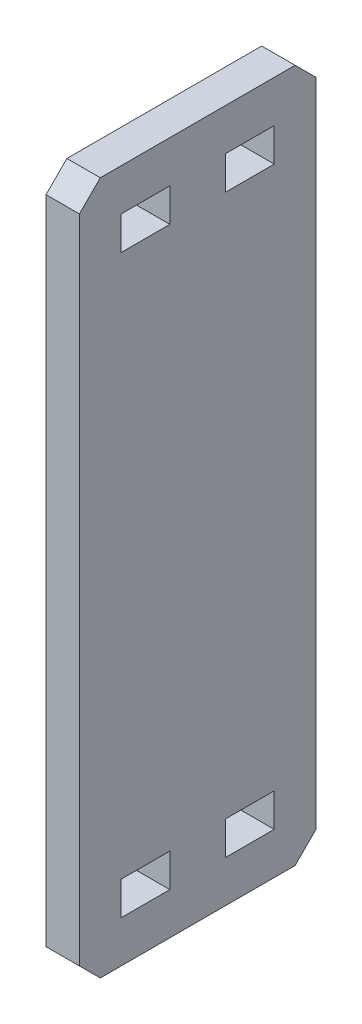
ISO-10303-21;
HEADER;
FILE_DESCRIPTION(('STEP AP214'),'2;1');
FILE_NAME('part.step','',(''),(''),'','','');
FILE_SCHEMA(('AUTOMOTIVE_DESIGN { 1 0 10303 214 1 1 1 1 }'));
ENDSEC;
DATA;
#1=APPLICATION_CONTEXT('core data for automotive mechanical design processes');
#2=APPLICATION_PROTOCOL_DEFINITION('international standard','automotive_design',2000,#1);
#3=PRODUCT_CONTEXT('',#1,'mechanical');
#4=PRODUCT('Part','Part','',(#3));
#5=PRODUCT_RELATED_PRODUCT_CATEGORY('part','',(#4));
#6=PRODUCT_DEFINITION_FORMATION('','',#4);
#7=PRODUCT_DEFINITION_CONTEXT('part definition',#1,'design');
#8=PRODUCT_DEFINITION('design','',#6,#7);
#9=PRODUCT_DEFINITION_SHAPE('','',#8);
#10=(LENGTH_UNIT() NAMED_UNIT(*) SI_UNIT(.MILLI.,.METRE.));
#11=(NAMED_UNIT(*) PLANE_ANGLE_UNIT() SI_UNIT($,.RADIAN.));
#12=(NAMED_UNIT(*) SI_UNIT($,.STERADIAN.) SOLID_ANGLE_UNIT());
#13=UNCERTAINTY_MEASURE_WITH_UNIT(LENGTH_MEASURE(1.E-05),#10,'distance_accuracy_value','');
#14=(GEOMETRIC_REPRESENTATION_CONTEXT(3) GLOBAL_UNCERTAINTY_ASSIGNED_CONTEXT((#13)) GLOBAL_UNIT_ASSIGNED_CONTEXT((#10,
#11,#12)) REPRESENTATION_CONTEXT('',''));
#15=CARTESIAN_POINT('',(0.,0.,0.));
#16=DIRECTION('',(0.,0.,1.));
#17=DIRECTION('',(1.,0.,0.));
#18=AXIS2_PLACEMENT_3D('',#15,#16,#17);
#19=CARTESIAN_POINT('',(3.048,0.,0.));
#20=DIRECTION('',(-1.,0.,0.));
#21=DIRECTION('',(0.,0.,1.));
#22=AXIS2_PLACEMENT_3D('',#19,#20,#21);
#23=PLANE('',#22);
#24=DIRECTION('',(0.,0.,1.));
#25=VECTOR('',#24,1.);
#26=CARTESIAN_POINT('',(3.048,-49.53,116.107292876109));
#27=LINE('',#26,#25);
#28=CARTESIAN_POINT('',(3.048,-49.53,116.107292876109));
#29=VERTEX_POINT('',#28);
#30=CARTESIAN_POINT('',(3.048,-49.53,124.997292876109));
#31=VERTEX_POINT('',#30);
#32=EDGE_CURVE('E238',#29,#31,#27,.T.);
#33=ORIENTED_EDGE('',*,*,#32,.F.);
#34=DIRECTION('',(0.,1.,0.));
#35=VECTOR('',#34,1.);
#36=CARTESIAN_POINT('',(3.048,-49.53,116.107292876109));
#37=LINE('',#36,#35);
#38=CARTESIAN_POINT('',(3.048,-55.626,116.107292876109));
#39=VERTEX_POINT('',#38);
#40=EDGE_CURVE('E246',#39,#29,#37,.T.);
#41=ORIENTED_EDGE('',*,*,#40,.F.);
#42=DIRECTION('',(0.,0.,-1.));
#43=VECTOR('',#42,1.);
#44=CARTESIAN_POINT('',(3.048,-55.626,116.107292876109));
#45=LINE('',#44,#43);
#46=CARTESIAN_POINT('',(3.048,-55.626,124.997292876109));
#47=VERTEX_POINT('',#46);
#48=EDGE_CURVE('E243',#47,#39,#45,.T.);
#49=ORIENTED_EDGE('',*,*,#48,.F.);
#50=DIRECTION('',(0.,-1.,0.));
#51=VECTOR('',#50,1.);
#52=CARTESIAN_POINT('',(3.048,-49.53,124.997292876109));
#53=LINE('',#52,#51);
#54=EDGE_CURVE('E240',#31,#47,#53,.T.);
#55=ORIENTED_EDGE('',*,*,#54,.F.);
#56=EDGE_LOOP('',(#33,#41,#49,#55));
#57=FACE_BOUND('',#56,.T.);
#58=DIRECTION('',(0.,-1.,0.));
#59=VECTOR('',#58,1.);
#60=CARTESIAN_POINT('',(3.048,55.626,105.947292876109));
#61=LINE('',#60,#59);
#62=CARTESIAN_POINT('',(3.048,55.626,105.947292876109));
#63=VERTEX_POINT('',#62);
#64=CARTESIAN_POINT('',(3.048,49.53,105.947292876109));
#65=VERTEX_POINT('',#64);
#66=EDGE_CURVE('E300',#63,#65,#61,.T.);
#67=ORIENTED_EDGE('',*,*,#66,.F.);
#68=DIRECTION('',(0.,0.,1.));
#69=VECTOR('',#68,1.);
#70=CARTESIAN_POINT('',(3.048,55.626,97.0572928761086));
#71=LINE('',#70,#69);
#72=CARTESIAN_POINT('',(3.048,55.626,97.0572928761086));
#73=VERTEX_POINT('',#72);
#74=EDGE_CURVE('E308',#73,#63,#71,.T.);
#75=ORIENTED_EDGE('',*,*,#74,.F.);
#76=DIRECTION('',(0.,1.,0.));
#77=VECTOR('',#76,1.);
#78=CARTESIAN_POINT('',(3.048,55.626,97.0572928761086));
#79=LINE('',#78,#77);
#80=CARTESIAN_POINT('',(3.048,49.53,97.0572928761086));
#81=VERTEX_POINT('',#80);
#82=EDGE_CURVE('E305',#81,#73,#79,.T.);
#83=ORIENTED_EDGE('',*,*,#82,.F.);
#84=DIRECTION('',(0.,0.,-1.));
#85=VECTOR('',#84,1.);
#86=CARTESIAN_POINT('',(3.048,49.53,97.0572928761086));
#87=LINE('',#86,#85);
#88=EDGE_CURVE('E302',#65,#81,#87,.T.);
#89=ORIENTED_EDGE('',*,*,#88,.F.);
#90=EDGE_LOOP('',(#67,#75,#83,#89));
#91=FACE_BOUND('',#90,.T.);
#92=DIRECTION('',(0.,0.,-1.));
#93=VECTOR('',#92,1.);
#94=CARTESIAN_POINT('',(3.048,-63.246,89.4372928761086));
#95=LINE('',#94,#93);
#96=CARTESIAN_POINT('',(3.048,-63.246,128.807292876109));
#97=VERTEX_POINT('',#96);
#98=CARTESIAN_POINT('',(3.048,-63.246,93.2472928761086));
#99=VERTEX_POINT('',#98);
#100=EDGE_CURVE('E339',#97,#99,#95,.T.);
#101=ORIENTED_EDGE('',*,*,#100,.T.);
#102=DIRECTION('',(0.,-0.707106781186546,0.707106781186549));
#103=VECTOR('',#102,1.);
#104=CARTESIAN_POINT('',(3.048,-59.436,89.4372928761086));
#105=LINE('',#104,#103);
#106=CARTESIAN_POINT('',(3.048,-59.436,89.4372928761086));
#107=VERTEX_POINT('',#106);
#108=EDGE_CURVE('E374',#99,#107,#105,.F.);
#109=ORIENTED_EDGE('',*,*,#108,.T.);
#110=DIRECTION('',(0.,1.,0.));
#111=VECTOR('',#110,1.);
#112=CARTESIAN_POINT('',(3.048,63.246,89.4372928761086));
#113=LINE('',#112,#111);
#114=CARTESIAN_POINT('',(3.048,59.436,89.4372928761086));
#115=VERTEX_POINT('',#114);
#116=EDGE_CURVE('E331',#107,#115,#113,.T.);
#117=ORIENTED_EDGE('',*,*,#116,.T.);
#118=DIRECTION('',(0.,-0.707106781186549,-0.707106781186546));
#119=VECTOR('',#118,1.);
#120=CARTESIAN_POINT('',(3.048,63.246,93.2472928761086));
#121=LINE('',#120,#119);
#122=CARTESIAN_POINT('',(3.048,63.246,93.2472928761086));
#123=VERTEX_POINT('',#122);
#124=EDGE_CURVE('E370',#115,#123,#121,.F.);
#125=ORIENTED_EDGE('',*,*,#124,.T.);
#126=DIRECTION('',(0.,0.,1.));
#127=VECTOR('',#126,1.);
#128=CARTESIAN_POINT('',(3.048,63.246,89.4372928761086));
#129=LINE('',#128,#127);
#130=CARTESIAN_POINT('',(3.048,63.246,128.807292876109));
#131=VERTEX_POINT('',#130);
#132=EDGE_CURVE('E334',#123,#131,#129,.T.);
#133=ORIENTED_EDGE('',*,*,#132,.T.);
#134=DIRECTION('',(0.,0.707106781186545,-0.70710678118655));
#135=VECTOR('',#134,1.);
#136=CARTESIAN_POINT('',(3.048,59.436,132.617292876109));
#137=LINE('',#136,#135);
#138=CARTESIAN_POINT('',(3.048,59.436,132.617292876109));
#139=VERTEX_POINT('',#138);
#140=EDGE_CURVE('E55',#131,#139,#137,.F.);
#141=ORIENTED_EDGE('',*,*,#140,.T.);
#142=DIRECTION('',(0.,-1.,0.));
#143=VECTOR('',#142,1.);
#144=CARTESIAN_POINT('',(3.048,63.246,132.617292876109));
#145=LINE('',#144,#143);
#146=CARTESIAN_POINT('',(3.048,-59.436,132.617292876109));
#147=VERTEX_POINT('',#146);
#148=EDGE_CURVE('E337',#139,#147,#145,.T.);
#149=ORIENTED_EDGE('',*,*,#148,.T.);
#150=DIRECTION('',(0.,0.707106781186544,0.707106781186551));
#151=VECTOR('',#150,1.);
#152=CARTESIAN_POINT('',(3.048,-63.246,128.807292876109));
#153=LINE('',#152,#151);
#154=EDGE_CURVE('E372',#147,#97,#153,.F.);
#155=ORIENTED_EDGE('',*,*,#154,.T.);
#156=EDGE_LOOP('',(#101,#109,#117,#125,#133,#141,#149,#155));
#157=FACE_BOUND('',#156,.T.);
#158=DIRECTION('',(0.,0.,1.));
#159=VECTOR('',#158,1.);
#160=CARTESIAN_POINT('',(3.048,55.626,116.107292876109));
#161=LINE('',#160,#159);
#162=CARTESIAN_POINT('',(3.048,55.626,116.107292876109));
#163=VERTEX_POINT('',#162);
#164=CARTESIAN_POINT('',(3.048,55.626,124.997292876109));
#165=VERTEX_POINT('',#164);
#166=EDGE_CURVE('E269',#163,#165,#161,.T.);
#167=ORIENTED_EDGE('',*,*,#166,.F.);
#168=DIRECTION('',(0.,1.,0.));
#169=VECTOR('',#168,1.);
#170=CARTESIAN_POINT('',(3.048,55.626,116.107292876109));
#171=LINE('',#170,#169);
#172=CARTESIAN_POINT('',(3.048,49.53,116.107292876109));
#173=VERTEX_POINT('',#172);
#174=EDGE_CURVE('E277',#173,#163,#171,.T.);
#175=ORIENTED_EDGE('',*,*,#174,.F.);
#176=DIRECTION('',(0.,0.,-1.));
#177=VECTOR('',#176,1.);
#178=CARTESIAN_POINT('',(3.048,49.53,116.107292876109));
#179=LINE('',#178,#177);
#180=CARTESIAN_POINT('',(3.048,49.53,124.997292876109));
#181=VERTEX_POINT('',#180);
#182=EDGE_CURVE('E274',#181,#173,#179,.T.);
#183=ORIENTED_EDGE('',*,*,#182,.F.);
#184=DIRECTION('',(0.,-1.,0.));
#185=VECTOR('',#184,1.);
#186=CARTESIAN_POINT('',(3.048,55.626,124.997292876109));
#187=LINE('',#186,#185);
#188=EDGE_CURVE('E271',#165,#181,#187,.T.);
#189=ORIENTED_EDGE('',*,*,#188,.F.);
#190=EDGE_LOOP('',(#167,#175,#183,#189));
#191=FACE_BOUND('',#190,.T.);
#192=DIRECTION('',(0.,-1.,0.));
#193=VECTOR('',#192,1.);
#194=CARTESIAN_POINT('',(3.048,-49.53,105.947292876109));
#195=LINE('',#194,#193);
#196=CARTESIAN_POINT('',(3.048,-49.53,105.947292876109));
#197=VERTEX_POINT('',#196);
#198=CARTESIAN_POINT('',(3.048,-55.626,105.947292876109));
#199=VERTEX_POINT('',#198);
#200=EDGE_CURVE('E197',#197,#199,#195,.T.);
#201=ORIENTED_EDGE('',*,*,#200,.F.);
#202=DIRECTION('',(0.,0.,1.));
#203=VECTOR('',#202,1.);
#204=CARTESIAN_POINT('',(3.048,-49.53,97.0572928761086));
#205=LINE('',#204,#203);
#206=CARTESIAN_POINT('',(3.048,-49.53,97.0572928761086));
#207=VERTEX_POINT('',#206);
#208=EDGE_CURVE('E222',#207,#197,#205,.T.);
#209=ORIENTED_EDGE('',*,*,#208,.F.);
#210=DIRECTION('',(0.,1.,0.));
#211=VECTOR('',#210,1.);
#212=CARTESIAN_POINT('',(3.048,-49.53,97.0572928761086));
#213=LINE('',#212,#211);
#214=CARTESIAN_POINT('',(3.048,-55.626,97.0572928761086));
#215=VERTEX_POINT('',#214);
#216=EDGE_CURVE('E220',#215,#207,#213,.T.);
#217=ORIENTED_EDGE('',*,*,#216,.F.);
#218=DIRECTION('',(0.,0.,-1.));
#219=VECTOR('',#218,1.);
#220=CARTESIAN_POINT('',(3.048,-55.626,97.0572928761086));
#221=LINE('',#220,#219);
#222=EDGE_CURVE('E207',#199,#215,#221,.T.);
#223=ORIENTED_EDGE('',*,*,#222,.F.);
#224=EDGE_LOOP('',(#201,#209,#217,#223));
#225=FACE_BOUND('',#224,.T.);
#226=ADVANCED_FACE('F33',(#57,#91,#157,#191,#225),#23,.F.);
#227=CARTESIAN_POINT('',(-3.048,0.,0.));
#228=DIRECTION('',(-1.,0.,0.));
#229=DIRECTION('',(0.,0.,1.));
#230=AXIS2_PLACEMENT_3D('',#227,#228,#229);
#231=PLANE('',#230);
#232=DIRECTION('',(0.,1.,0.));
#233=VECTOR('',#232,1.);
#234=CARTESIAN_POINT('',(-3.048,63.246,89.4372928761086));
#235=LINE('',#234,#233);
#236=CARTESIAN_POINT('',(-3.048,-59.436,89.4372928761086));
#237=VERTEX_POINT('',#236);
#238=CARTESIAN_POINT('',(-3.048,59.436,89.4372928761086));
#239=VERTEX_POINT('',#238);
#240=EDGE_CURVE('E330',#237,#239,#235,.T.);
#241=ORIENTED_EDGE('',*,*,#240,.F.);
#242=DIRECTION('',(0.,0.707106781186546,-0.707106781186549));
#243=VECTOR('',#242,1.);
#244=CARTESIAN_POINT('',(-3.048,15.0006464380542,15.0006464380541));
#245=LINE('',#244,#243);
#246=CARTESIAN_POINT('',(-3.048,-63.246,93.2472928761086));
#247=VERTEX_POINT('',#246);
#248=EDGE_CURVE('E362',#237,#247,#245,.F.);
#249=ORIENTED_EDGE('',*,*,#248,.T.);
#250=DIRECTION('',(0.,0.,-1.));
#251=VECTOR('',#250,1.);
#252=CARTESIAN_POINT('',(-3.048,-63.246,89.4372928761086));
#253=LINE('',#252,#251);
#254=CARTESIAN_POINT('',(-3.048,-63.246,128.807292876109));
#255=VERTEX_POINT('',#254);
#256=EDGE_CURVE('E335',#255,#247,#253,.T.);
#257=ORIENTED_EDGE('',*,*,#256,.F.);
#258=DIRECTION('',(0.,-0.707106781186544,-0.707106781186551));
#259=VECTOR('',#258,1.);
#260=CARTESIAN_POINT('',(-3.048,-96.0266464380547,96.0266464380536));
#261=LINE('',#260,#259);
#262=CARTESIAN_POINT('',(-3.048,-59.436,132.617292876109));
#263=VERTEX_POINT('',#262);
#264=EDGE_CURVE('E360',#255,#263,#261,.F.);
#265=ORIENTED_EDGE('',*,*,#264,.T.);
#266=DIRECTION('',(0.,-1.,0.));
#267=VECTOR('',#266,1.);
#268=CARTESIAN_POINT('',(-3.048,63.246,132.617292876109));
#269=LINE('',#268,#267);
#270=CARTESIAN_POINT('',(-3.048,59.436,132.617292876109));
#271=VERTEX_POINT('',#270);
#272=EDGE_CURVE('E348',#271,#263,#269,.T.);
#273=ORIENTED_EDGE('',*,*,#272,.F.);
#274=DIRECTION('',(0.,-0.707106781186545,0.70710678118655));
#275=VECTOR('',#274,1.);
#276=CARTESIAN_POINT('',(-3.048,96.0266464380545,96.0266464380538));
#277=LINE('',#276,#275);
#278=CARTESIAN_POINT('',(-3.048,63.246,128.807292876109));
#279=VERTEX_POINT('',#278);
#280=EDGE_CURVE('E356',#271,#279,#277,.F.);
#281=ORIENTED_EDGE('',*,*,#280,.T.);
#282=DIRECTION('',(0.,0.,1.));
#283=VECTOR('',#282,1.);
#284=CARTESIAN_POINT('',(-3.048,63.246,89.4372928761086));
#285=LINE('',#284,#283);
#286=CARTESIAN_POINT('',(-3.048,63.246,93.2472928761086));
#287=VERTEX_POINT('',#286);
#288=EDGE_CURVE('E345',#287,#279,#285,.T.);
#289=ORIENTED_EDGE('',*,*,#288,.F.);
#290=DIRECTION('',(0.,0.707106781186549,0.707106781186546));
#291=VECTOR('',#290,1.);
#292=CARTESIAN_POINT('',(-3.048,-15.0006464380545,15.0006464380546));
#293=LINE('',#292,#291);
#294=EDGE_CURVE('E358',#287,#239,#293,.F.);
#295=ORIENTED_EDGE('',*,*,#294,.T.);
#296=EDGE_LOOP('',(#241,#249,#257,#265,#273,#281,#289,#295));
#297=FACE_BOUND('',#296,.T.);
#298=DIRECTION('',(0.,0.,1.));
#299=VECTOR('',#298,1.);
#300=CARTESIAN_POINT('',(-3.048,55.626,97.0572928761086));
#301=LINE('',#300,#299);
#302=CARTESIAN_POINT('',(-3.048,55.626,97.0572928761086));
#303=VERTEX_POINT('',#302);
#304=CARTESIAN_POINT('',(-3.048,55.626,105.947292876109));
#305=VERTEX_POINT('',#304);
#306=EDGE_CURVE('E303',#303,#305,#301,.T.);
#307=ORIENTED_EDGE('',*,*,#306,.T.);
#308=DIRECTION('',(0.,-1.,0.));
#309=VECTOR('',#308,1.);
#310=CARTESIAN_POINT('',(-3.048,55.626,105.947292876109));
#311=LINE('',#310,#309);
#312=CARTESIAN_POINT('',(-3.048,49.53,105.947292876109));
#313=VERTEX_POINT('',#312);
#314=EDGE_CURVE('E299',#305,#313,#311,.T.);
#315=ORIENTED_EDGE('',*,*,#314,.T.);
#316=DIRECTION('',(0.,0.,-1.));
#317=VECTOR('',#316,1.);
#318=CARTESIAN_POINT('',(-3.048,49.53,97.0572928761086));
#319=LINE('',#318,#317);
#320=CARTESIAN_POINT('',(-3.048,49.53,97.0572928761086));
#321=VERTEX_POINT('',#320);
#322=EDGE_CURVE('E313',#313,#321,#319,.T.);
#323=ORIENTED_EDGE('',*,*,#322,.T.);
#324=DIRECTION('',(0.,1.,0.));
#325=VECTOR('',#324,1.);
#326=CARTESIAN_POINT('',(-3.048,55.626,97.0572928761086));
#327=LINE('',#326,#325);
#328=EDGE_CURVE('E316',#321,#303,#327,.T.);
#329=ORIENTED_EDGE('',*,*,#328,.T.);
#330=EDGE_LOOP('',(#307,#315,#323,#329));
#331=FACE_BOUND('',#330,.T.);
#332=DIRECTION('',(0.,1.,0.));
#333=VECTOR('',#332,1.);
#334=CARTESIAN_POINT('',(-3.048,55.626,116.107292876109));
#335=LINE('',#334,#333);
#336=CARTESIAN_POINT('',(-3.048,49.53,116.107292876109));
#337=VERTEX_POINT('',#336);
#338=CARTESIAN_POINT('',(-3.048,55.626,116.107292876109));
#339=VERTEX_POINT('',#338);
#340=EDGE_CURVE('E272',#337,#339,#335,.T.);
#341=ORIENTED_EDGE('',*,*,#340,.T.);
#342=DIRECTION('',(0.,0.,1.));
#343=VECTOR('',#342,1.);
#344=CARTESIAN_POINT('',(-3.048,55.626,116.107292876109));
#345=LINE('',#344,#343);
#346=CARTESIAN_POINT('',(-3.048,55.626,124.997292876109));
#347=VERTEX_POINT('',#346);
#348=EDGE_CURVE('E268',#339,#347,#345,.T.);
#349=ORIENTED_EDGE('',*,*,#348,.T.);
#350=DIRECTION('',(0.,-1.,0.));
#351=VECTOR('',#350,1.);
#352=CARTESIAN_POINT('',(-3.048,55.626,124.997292876109));
#353=LINE('',#352,#351);
#354=CARTESIAN_POINT('',(-3.048,49.53,124.997292876109));
#355=VERTEX_POINT('',#354);
#356=EDGE_CURVE('E282',#347,#355,#353,.T.);
#357=ORIENTED_EDGE('',*,*,#356,.T.);
#358=DIRECTION('',(0.,0.,-1.));
#359=VECTOR('',#358,1.);
#360=CARTESIAN_POINT('',(-3.048,49.53,116.107292876109));
#361=LINE('',#360,#359);
#362=EDGE_CURVE('E285',#355,#337,#361,.T.);
#363=ORIENTED_EDGE('',*,*,#362,.T.);
#364=EDGE_LOOP('',(#341,#349,#357,#363));
#365=FACE_BOUND('',#364,.T.);
#366=DIRECTION('',(0.,1.,0.));
#367=VECTOR('',#366,1.);
#368=CARTESIAN_POINT('',(-3.048,-49.53,116.107292876109));
#369=LINE('',#368,#367);
#370=CARTESIAN_POINT('',(-3.048,-55.626,116.107292876109));
#371=VERTEX_POINT('',#370);
#372=CARTESIAN_POINT('',(-3.048,-49.53,116.107292876109));
#373=VERTEX_POINT('',#372);
#374=EDGE_CURVE('E241',#371,#373,#369,.T.);
#375=ORIENTED_EDGE('',*,*,#374,.T.);
#376=DIRECTION('',(0.,0.,1.));
#377=VECTOR('',#376,1.);
#378=CARTESIAN_POINT('',(-3.048,-49.53,116.107292876109));
#379=LINE('',#378,#377);
#380=CARTESIAN_POINT('',(-3.048,-49.53,124.997292876109));
#381=VERTEX_POINT('',#380);
#382=EDGE_CURVE('E215',#373,#381,#379,.T.);
#383=ORIENTED_EDGE('',*,*,#382,.T.);
#384=DIRECTION('',(0.,-1.,0.));
#385=VECTOR('',#384,1.);
#386=CARTESIAN_POINT('',(-3.048,-49.53,124.997292876109));
#387=LINE('',#386,#385);
#388=CARTESIAN_POINT('',(-3.048,-55.626,124.997292876109));
#389=VERTEX_POINT('',#388);
#390=EDGE_CURVE('E251',#381,#389,#387,.T.);
#391=ORIENTED_EDGE('',*,*,#390,.T.);
#392=DIRECTION('',(0.,0.,-1.));
#393=VECTOR('',#392,1.);
#394=CARTESIAN_POINT('',(-3.048,-55.626,116.107292876109));
#395=LINE('',#394,#393);
#396=EDGE_CURVE('E254',#389,#371,#395,.T.);
#397=ORIENTED_EDGE('',*,*,#396,.T.);
#398=EDGE_LOOP('',(#375,#383,#391,#397));
#399=FACE_BOUND('',#398,.T.);
#400=DIRECTION('',(0.,0.,1.));
#401=VECTOR('',#400,1.);
#402=CARTESIAN_POINT('',(-3.048,-49.53,97.0572928761086));
#403=LINE('',#402,#401);
#404=CARTESIAN_POINT('',(-3.048,-49.53,97.0572928761086));
#405=VERTEX_POINT('',#404);
#406=CARTESIAN_POINT('',(-3.048,-49.53,105.947292876109));
#407=VERTEX_POINT('',#406);
#408=EDGE_CURVE('E208',#405,#407,#403,.T.);
#409=ORIENTED_EDGE('',*,*,#408,.T.);
#410=DIRECTION('',(0.,-1.,0.));
#411=VECTOR('',#410,1.);
#412=CARTESIAN_POINT('',(-3.048,-49.53,105.947292876109));
#413=LINE('',#412,#411);
#414=CARTESIAN_POINT('',(-3.048,-55.626,105.947292876109));
#415=VERTEX_POINT('',#414);
#416=EDGE_CURVE('E226',#407,#415,#413,.T.);
#417=ORIENTED_EDGE('',*,*,#416,.T.);
#418=DIRECTION('',(0.,0.,-1.));
#419=VECTOR('',#418,1.);
#420=CARTESIAN_POINT('',(-3.048,-55.626,97.0572928761086));
#421=LINE('',#420,#419);
#422=CARTESIAN_POINT('',(-3.048,-55.626,97.0572928761086));
#423=VERTEX_POINT('',#422);
#424=EDGE_CURVE('E214',#415,#423,#421,.T.);
#425=ORIENTED_EDGE('',*,*,#424,.T.);
#426=DIRECTION('',(0.,1.,0.));
#427=VECTOR('',#426,1.);
#428=CARTESIAN_POINT('',(-3.048,-49.53,97.0572928761086));
#429=LINE('',#428,#427);
#430=EDGE_CURVE('E229',#423,#405,#429,.T.);
#431=ORIENTED_EDGE('',*,*,#430,.T.);
#432=EDGE_LOOP('',(#409,#417,#425,#431));
#433=FACE_BOUND('',#432,.T.);
#434=ADVANCED_FACE('F393',(#297,#331,#365,#399,#433),#231,.T.);
#435=CARTESIAN_POINT('',(3.048,63.246,89.4372928761086));
#436=DIRECTION('',(0.,0.,1.));
#437=DIRECTION('',(0.,-1.,0.));
#438=AXIS2_PLACEMENT_3D('',#435,#436,#437);
#439=PLANE('',#438);
#440=ORIENTED_EDGE('',*,*,#116,.F.);
#441=DIRECTION('',(-1.,0.,0.));
#442=VECTOR('',#441,1.);
#443=CARTESIAN_POINT('',(3.048,-59.436,89.4372928761086));
#444=LINE('',#443,#442);
#445=EDGE_CURVE('E353',#107,#237,#444,.T.);
#446=ORIENTED_EDGE('',*,*,#445,.T.);
#447=ORIENTED_EDGE('',*,*,#240,.T.);
#448=DIRECTION('',(1.,0.,0.));
#449=VECTOR('',#448,1.);
#450=CARTESIAN_POINT('',(3.048,59.436,89.4372928761086));
#451=LINE('',#450,#449);
#452=EDGE_CURVE('E342',#239,#115,#451,.T.);
#453=ORIENTED_EDGE('',*,*,#452,.T.);
#454=EDGE_LOOP('',(#440,#446,#447,#453));
#455=FACE_BOUND('',#454,.T.);
#456=ADVANCED_FACE('F410',(#455),#439,.F.);
#457=CARTESIAN_POINT('',(3.048,63.246,89.4372928761086));
#458=DIRECTION('',(0.,-1.,0.));
#459=DIRECTION('',(0.,0.,-1.));
#460=AXIS2_PLACEMENT_3D('',#457,#458,#459);
#461=PLANE('',#460);
#462=ORIENTED_EDGE('',*,*,#132,.F.);
#463=DIRECTION('',(-1.,0.,0.));
#464=VECTOR('',#463,1.);
#465=CARTESIAN_POINT('',(3.048,63.246,93.2472928761086));
#466=LINE('',#465,#464);
#467=EDGE_CURVE('E11',#123,#287,#466,.T.);
#468=ORIENTED_EDGE('',*,*,#467,.T.);
#469=ORIENTED_EDGE('',*,*,#288,.T.);
#470=DIRECTION('',(1.,0.,0.));
#471=VECTOR('',#470,1.);
#472=CARTESIAN_POINT('',(3.048,63.246,128.807292876109));
#473=LINE('',#472,#471);
#474=EDGE_CURVE('E41',#279,#131,#473,.T.);
#475=ORIENTED_EDGE('',*,*,#474,.T.);
#476=EDGE_LOOP('',(#462,#468,#469,#475));
#477=FACE_BOUND('',#476,.T.);
#478=ADVANCED_FACE('F382',(#477),#461,.F.);
#479=CARTESIAN_POINT('',(3.048,63.246,132.617292876109));
#480=DIRECTION('',(0.,0.,-1.));
#481=DIRECTION('',(-1.,0.,0.));
#482=AXIS2_PLACEMENT_3D('',#479,#480,#481);
#483=PLANE('',#482);
#484=ORIENTED_EDGE('',*,*,#272,.T.);
#485=DIRECTION('',(1.,0.,0.));
#486=VECTOR('',#485,1.);
#487=CARTESIAN_POINT('',(3.048,-59.436,132.617292876109));
#488=LINE('',#487,#486);
#489=EDGE_CURVE('E48',#263,#147,#488,.T.);
#490=ORIENTED_EDGE('',*,*,#489,.T.);
#491=ORIENTED_EDGE('',*,*,#148,.F.);
#492=DIRECTION('',(-1.,0.,0.));
#493=VECTOR('',#492,1.);
#494=CARTESIAN_POINT('',(3.048,59.436,132.617292876109));
#495=LINE('',#494,#493);
#496=EDGE_CURVE('E376',#139,#271,#495,.T.);
#497=ORIENTED_EDGE('',*,*,#496,.T.);
#498=EDGE_LOOP('',(#484,#490,#491,#497));
#499=FACE_BOUND('',#498,.T.);
#500=ADVANCED_FACE('F390',(#499),#483,.F.);
#501=CARTESIAN_POINT('',(3.048,-63.246,89.4372928761086));
#502=DIRECTION('',(0.,1.,0.));
#503=DIRECTION('',(0.,0.,1.));
#504=AXIS2_PLACEMENT_3D('',#501,#502,#503);
#505=PLANE('',#504);
#506=ORIENTED_EDGE('',*,*,#256,.T.);
#507=DIRECTION('',(1.,0.,0.));
#508=VECTOR('',#507,1.);
#509=CARTESIAN_POINT('',(3.048,-63.246,93.2472928761086));
#510=LINE('',#509,#508);
#511=EDGE_CURVE('E367',#247,#99,#510,.T.);
#512=ORIENTED_EDGE('',*,*,#511,.T.);
#513=ORIENTED_EDGE('',*,*,#100,.F.);
#514=DIRECTION('',(-1.,0.,0.));
#515=VECTOR('',#514,1.);
#516=CARTESIAN_POINT('',(3.048,-63.246,128.807292876109));
#517=LINE('',#516,#515);
#518=EDGE_CURVE('E364',#97,#255,#517,.T.);
#519=ORIENTED_EDGE('',*,*,#518,.T.);
#520=EDGE_LOOP('',(#506,#512,#513,#519));
#521=FACE_BOUND('',#520,.T.);
#522=ADVANCED_FACE('F402',(#521),#505,.F.);
#523=CARTESIAN_POINT('',(3.048,55.626,105.947292876109));
#524=DIRECTION('',(0.,0.,-1.));
#525=DIRECTION('',(-1.,0.,0.));
#526=AXIS2_PLACEMENT_3D('',#523,#524,#525);
#527=PLANE('',#526);
#528=ORIENTED_EDGE('',*,*,#314,.F.);
#529=DIRECTION('',(-1.,0.,0.));
#530=VECTOR('',#529,1.);
#531=CARTESIAN_POINT('',(3.048,55.626,105.947292876109));
#532=LINE('',#531,#530);
#533=EDGE_CURVE('E310',#63,#305,#532,.T.);
#534=ORIENTED_EDGE('',*,*,#533,.F.);
#535=ORIENTED_EDGE('',*,*,#66,.T.);
#536=DIRECTION('',(-1.,0.,0.));
#537=VECTOR('',#536,1.);
#538=CARTESIAN_POINT('',(3.048,49.53,105.947292876109));
#539=LINE('',#538,#537);
#540=EDGE_CURVE('E327',#65,#313,#539,.T.);
#541=ORIENTED_EDGE('',*,*,#540,.T.);
#542=EDGE_LOOP('',(#528,#534,#535,#541));
#543=FACE_BOUND('',#542,.T.);
#544=ADVANCED_FACE('F430',(#543),#527,.T.);
#545=CARTESIAN_POINT('',(3.048,49.53,97.0572928761086));
#546=DIRECTION('',(0.,1.,0.));
#547=DIRECTION('',(0.,0.,1.));
#548=AXIS2_PLACEMENT_3D('',#545,#546,#547);
#549=PLANE('',#548);
#550=ORIENTED_EDGE('',*,*,#322,.F.);
#551=ORIENTED_EDGE('',*,*,#540,.F.);
#552=ORIENTED_EDGE('',*,*,#88,.T.);
#553=DIRECTION('',(-1.,0.,0.));
#554=VECTOR('',#553,1.);
#555=CARTESIAN_POINT('',(3.048,49.53,97.0572928761086));
#556=LINE('',#555,#554);
#557=EDGE_CURVE('E325',#81,#321,#556,.T.);
#558=ORIENTED_EDGE('',*,*,#557,.T.);
#559=EDGE_LOOP('',(#550,#551,#552,#558));
#560=FACE_BOUND('',#559,.T.);
#561=ADVANCED_FACE('F498',(#560),#549,.T.);
#562=CARTESIAN_POINT('',(3.048,55.626,97.0572928761086));
#563=DIRECTION('',(0.,0.,1.));
#564=DIRECTION('',(1.,0.,0.));
#565=AXIS2_PLACEMENT_3D('',#562,#563,#564);
#566=PLANE('',#565);
#567=ORIENTED_EDGE('',*,*,#328,.F.);
#568=ORIENTED_EDGE('',*,*,#557,.F.);
#569=ORIENTED_EDGE('',*,*,#82,.T.);
#570=DIRECTION('',(-1.,0.,0.));
#571=VECTOR('',#570,1.);
#572=CARTESIAN_POINT('',(3.048,55.626,97.0572928761086));
#573=LINE('',#572,#571);
#574=EDGE_CURVE('E323',#73,#303,#573,.T.);
#575=ORIENTED_EDGE('',*,*,#574,.T.);
#576=EDGE_LOOP('',(#567,#568,#569,#575));
#577=FACE_BOUND('',#576,.T.);
#578=ADVANCED_FACE('F495',(#577),#566,.T.);
#579=CARTESIAN_POINT('',(3.048,55.626,97.0572928761086));
#580=DIRECTION('',(0.,-1.,0.));
#581=DIRECTION('',(0.,0.,-1.));
#582=AXIS2_PLACEMENT_3D('',#579,#580,#581);
#583=PLANE('',#582);
#584=ORIENTED_EDGE('',*,*,#306,.F.);
#585=ORIENTED_EDGE('',*,*,#574,.F.);
#586=ORIENTED_EDGE('',*,*,#74,.T.);
#587=ORIENTED_EDGE('',*,*,#533,.T.);
#588=EDGE_LOOP('',(#584,#585,#586,#587));
#589=FACE_BOUND('',#588,.T.);
#590=ADVANCED_FACE('F491',(#589),#583,.T.);
#591=CARTESIAN_POINT('',(3.048,55.626,116.107292876109));
#592=DIRECTION('',(0.,-1.,0.));
#593=DIRECTION('',(0.,0.,-1.));
#594=AXIS2_PLACEMENT_3D('',#591,#592,#593);
#595=PLANE('',#594);
#596=ORIENTED_EDGE('',*,*,#348,.F.);
#597=DIRECTION('',(-1.,0.,0.));
#598=VECTOR('',#597,1.);
#599=CARTESIAN_POINT('',(3.048,55.626,116.107292876109));
#600=LINE('',#599,#598);
#601=EDGE_CURVE('E279',#163,#339,#600,.T.);
#602=ORIENTED_EDGE('',*,*,#601,.F.);
#603=ORIENTED_EDGE('',*,*,#166,.T.);
#604=DIRECTION('',(-1.,0.,0.));
#605=VECTOR('',#604,1.);
#606=CARTESIAN_POINT('',(3.048,55.626,124.997292876109));
#607=LINE('',#606,#605);
#608=EDGE_CURVE('E296',#165,#347,#607,.T.);
#609=ORIENTED_EDGE('',*,*,#608,.T.);
#610=EDGE_LOOP('',(#596,#602,#603,#609));
#611=FACE_BOUND('',#610,.T.);
#612=ADVANCED_FACE('F487',(#611),#595,.T.);
#613=CARTESIAN_POINT('',(3.048,55.626,124.997292876109));
#614=DIRECTION('',(0.,0.,-1.));
#615=DIRECTION('',(-1.,0.,0.));
#616=AXIS2_PLACEMENT_3D('',#613,#614,#615);
#617=PLANE('',#616);
#618=ORIENTED_EDGE('',*,*,#356,.F.);
#619=ORIENTED_EDGE('',*,*,#608,.F.);
#620=ORIENTED_EDGE('',*,*,#188,.T.);
#621=DIRECTION('',(-1.,0.,0.));
#622=VECTOR('',#621,1.);
#623=CARTESIAN_POINT('',(3.048,49.53,124.997292876109));
#624=LINE('',#623,#622);
#625=EDGE_CURVE('E294',#181,#355,#624,.T.);
#626=ORIENTED_EDGE('',*,*,#625,.T.);
#627=EDGE_LOOP('',(#618,#619,#620,#626));
#628=FACE_BOUND('',#627,.T.);
#629=ADVANCED_FACE('F483',(#628),#617,.T.);
#630=CARTESIAN_POINT('',(3.048,49.53,116.107292876109));
#631=DIRECTION('',(0.,1.,0.));
#632=DIRECTION('',(0.,0.,1.));
#633=AXIS2_PLACEMENT_3D('',#630,#631,#632);
#634=PLANE('',#633);
#635=ORIENTED_EDGE('',*,*,#362,.F.);
#636=ORIENTED_EDGE('',*,*,#625,.F.);
#637=ORIENTED_EDGE('',*,*,#182,.T.);
#638=DIRECTION('',(-1.,0.,0.));
#639=VECTOR('',#638,1.);
#640=CARTESIAN_POINT('',(3.048,49.53,116.107292876109));
#641=LINE('',#640,#639);
#642=EDGE_CURVE('E292',#173,#337,#641,.T.);
#643=ORIENTED_EDGE('',*,*,#642,.T.);
#644=EDGE_LOOP('',(#635,#636,#637,#643));
#645=FACE_BOUND('',#644,.T.);
#646=ADVANCED_FACE('F479',(#645),#634,.T.);
#647=CARTESIAN_POINT('',(3.048,55.626,116.107292876109));
#648=DIRECTION('',(0.,0.,1.));
#649=DIRECTION('',(1.,0.,0.));
#650=AXIS2_PLACEMENT_3D('',#647,#648,#649);
#651=PLANE('',#650);
#652=ORIENTED_EDGE('',*,*,#340,.F.);
#653=ORIENTED_EDGE('',*,*,#642,.F.);
#654=ORIENTED_EDGE('',*,*,#174,.T.);
#655=ORIENTED_EDGE('',*,*,#601,.T.);
#656=EDGE_LOOP('',(#652,#653,#654,#655));
#657=FACE_BOUND('',#656,.T.);
#658=ADVANCED_FACE('F475',(#657),#651,.T.);
#659=CARTESIAN_POINT('',(3.048,-49.53,116.107292876109));
#660=DIRECTION('',(0.,-1.,0.));
#661=DIRECTION('',(0.,0.,-1.));
#662=AXIS2_PLACEMENT_3D('',#659,#660,#661);
#663=PLANE('',#662);
#664=ORIENTED_EDGE('',*,*,#382,.F.);
#665=DIRECTION('',(-1.,0.,0.));
#666=VECTOR('',#665,1.);
#667=CARTESIAN_POINT('',(3.048,-49.53,116.107292876109));
#668=LINE('',#667,#666);
#669=EDGE_CURVE('E248',#29,#373,#668,.T.);
#670=ORIENTED_EDGE('',*,*,#669,.F.);
#671=ORIENTED_EDGE('',*,*,#32,.T.);
#672=DIRECTION('',(-1.,0.,0.));
#673=VECTOR('',#672,1.);
#674=CARTESIAN_POINT('',(3.048,-49.53,124.997292876109));
#675=LINE('',#674,#673);
#676=EDGE_CURVE('E265',#31,#381,#675,.T.);
#677=ORIENTED_EDGE('',*,*,#676,.T.);
#678=EDGE_LOOP('',(#664,#670,#671,#677));
#679=FACE_BOUND('',#678,.T.);
#680=ADVANCED_FACE('F471',(#679),#663,.T.);
#681=CARTESIAN_POINT('',(3.048,-49.53,124.997292876109));
#682=DIRECTION('',(0.,0.,-1.));
#683=DIRECTION('',(-1.,0.,0.));
#684=AXIS2_PLACEMENT_3D('',#681,#682,#683);
#685=PLANE('',#684);
#686=ORIENTED_EDGE('',*,*,#390,.F.);
#687=ORIENTED_EDGE('',*,*,#676,.F.);
#688=ORIENTED_EDGE('',*,*,#54,.T.);
#689=DIRECTION('',(-1.,0.,0.));
#690=VECTOR('',#689,1.);
#691=CARTESIAN_POINT('',(3.048,-55.626,124.997292876109));
#692=LINE('',#691,#690);
#693=EDGE_CURVE('E263',#47,#389,#692,.T.);
#694=ORIENTED_EDGE('',*,*,#693,.T.);
#695=EDGE_LOOP('',(#686,#687,#688,#694));
#696=FACE_BOUND('',#695,.T.);
#697=ADVANCED_FACE('F467',(#696),#685,.T.);
#698=CARTESIAN_POINT('',(3.048,-55.626,116.107292876109));
#699=DIRECTION('',(0.,1.,0.));
#700=DIRECTION('',(0.,0.,1.));
#701=AXIS2_PLACEMENT_3D('',#698,#699,#700);
#702=PLANE('',#701);
#703=ORIENTED_EDGE('',*,*,#396,.F.);
#704=ORIENTED_EDGE('',*,*,#693,.F.);
#705=ORIENTED_EDGE('',*,*,#48,.T.);
#706=DIRECTION('',(-1.,0.,0.));
#707=VECTOR('',#706,1.);
#708=CARTESIAN_POINT('',(3.048,-55.626,116.107292876109));
#709=LINE('',#708,#707);
#710=EDGE_CURVE('E261',#39,#371,#709,.T.);
#711=ORIENTED_EDGE('',*,*,#710,.T.);
#712=EDGE_LOOP('',(#703,#704,#705,#711));
#713=FACE_BOUND('',#712,.T.);
#714=ADVANCED_FACE('F463',(#713),#702,.T.);
#715=CARTESIAN_POINT('',(3.048,-49.53,116.107292876109));
#716=DIRECTION('',(0.,0.,1.));
#717=DIRECTION('',(1.,0.,0.));
#718=AXIS2_PLACEMENT_3D('',#715,#716,#717);
#719=PLANE('',#718);
#720=ORIENTED_EDGE('',*,*,#374,.F.);
#721=ORIENTED_EDGE('',*,*,#710,.F.);
#722=ORIENTED_EDGE('',*,*,#40,.T.);
#723=ORIENTED_EDGE('',*,*,#669,.T.);
#724=EDGE_LOOP('',(#720,#721,#722,#723));
#725=FACE_BOUND('',#724,.T.);
#726=ADVANCED_FACE('F460',(#725),#719,.T.);
#727=CARTESIAN_POINT('',(3.048,-49.53,105.947292876109));
#728=DIRECTION('',(0.,0.,-1.));
#729=DIRECTION('',(-1.,0.,0.));
#730=AXIS2_PLACEMENT_3D('',#727,#728,#729);
#731=PLANE('',#730);
#732=ORIENTED_EDGE('',*,*,#416,.F.);
#733=DIRECTION('',(-1.,0.,0.));
#734=VECTOR('',#733,1.);
#735=CARTESIAN_POINT('',(3.048,-49.53,105.947292876109));
#736=LINE('',#735,#734);
#737=EDGE_CURVE('E203',#197,#407,#736,.T.);
#738=ORIENTED_EDGE('',*,*,#737,.F.);
#739=ORIENTED_EDGE('',*,*,#200,.T.);
#740=DIRECTION('',(-1.,0.,0.));
#741=VECTOR('',#740,1.);
#742=CARTESIAN_POINT('',(3.048,-55.626,105.947292876109));
#743=LINE('',#742,#741);
#744=EDGE_CURVE('E200',#199,#415,#743,.T.);
#745=ORIENTED_EDGE('',*,*,#744,.T.);
#746=EDGE_LOOP('',(#732,#738,#739,#745));
#747=FACE_BOUND('',#746,.T.);
#748=ADVANCED_FACE('F199',(#747),#731,.T.);
#749=CARTESIAN_POINT('',(3.048,-55.626,97.0572928761086));
#750=DIRECTION('',(0.,1.,0.));
#751=DIRECTION('',(0.,0.,1.));
#752=AXIS2_PLACEMENT_3D('',#749,#750,#751);
#753=PLANE('',#752);
#754=ORIENTED_EDGE('',*,*,#424,.F.);
#755=ORIENTED_EDGE('',*,*,#744,.F.);
#756=ORIENTED_EDGE('',*,*,#222,.T.);
#757=DIRECTION('',(-1.,0.,0.));
#758=VECTOR('',#757,1.);
#759=CARTESIAN_POINT('',(3.048,-55.626,97.0572928761086));
#760=LINE('',#759,#758);
#761=EDGE_CURVE('E216',#215,#423,#760,.T.);
#762=ORIENTED_EDGE('',*,*,#761,.T.);
#763=EDGE_LOOP('',(#754,#755,#756,#762));
#764=FACE_BOUND('',#763,.T.);
#765=ADVANCED_FACE('F211',(#764),#753,.T.);
#766=CARTESIAN_POINT('',(3.048,-49.53,97.0572928761086));
#767=DIRECTION('',(0.,0.,1.));
#768=DIRECTION('',(1.,0.,0.));
#769=AXIS2_PLACEMENT_3D('',#766,#767,#768);
#770=PLANE('',#769);
#771=ORIENTED_EDGE('',*,*,#430,.F.);
#772=ORIENTED_EDGE('',*,*,#761,.F.);
#773=ORIENTED_EDGE('',*,*,#216,.T.);
#774=DIRECTION('',(-1.,0.,0.));
#775=VECTOR('',#774,1.);
#776=CARTESIAN_POINT('',(3.048,-49.53,97.0572928761086));
#777=LINE('',#776,#775);
#778=EDGE_CURVE('E235',#207,#405,#777,.T.);
#779=ORIENTED_EDGE('',*,*,#778,.T.);
#780=EDGE_LOOP('',(#771,#772,#773,#779));
#781=FACE_BOUND('',#780,.T.);
#782=ADVANCED_FACE('F446',(#781),#770,.T.);
#783=CARTESIAN_POINT('',(3.048,-49.53,97.0572928761086));
#784=DIRECTION('',(0.,-1.,0.));
#785=DIRECTION('',(0.,0.,-1.));
#786=AXIS2_PLACEMENT_3D('',#783,#784,#785);
#787=PLANE('',#786);
#788=ORIENTED_EDGE('',*,*,#408,.F.);
#789=ORIENTED_EDGE('',*,*,#778,.F.);
#790=ORIENTED_EDGE('',*,*,#208,.T.);
#791=ORIENTED_EDGE('',*,*,#737,.T.);
#792=EDGE_LOOP('',(#788,#789,#790,#791));
#793=FACE_BOUND('',#792,.T.);
#794=ADVANCED_FACE('F442',(#793),#787,.T.);
#795=CARTESIAN_POINT('',(3.048,-59.436,89.4372928761086));
#796=DIRECTION('',(0.,0.707106781186549,0.707106781186546));
#797=DIRECTION('',(-1.,0.,0.));
#798=AXIS2_PLACEMENT_3D('',#795,#796,#797);
#799=PLANE('',#798);
#800=ORIENTED_EDGE('',*,*,#108,.F.);
#801=ORIENTED_EDGE('',*,*,#511,.F.);
#802=ORIENTED_EDGE('',*,*,#248,.F.);
#803=ORIENTED_EDGE('',*,*,#445,.F.);
#804=EDGE_LOOP('',(#800,#801,#802,#803));
#805=FACE_BOUND('',#804,.T.);
#806=ADVANCED_FACE('F408',(#805),#799,.F.);
#807=CARTESIAN_POINT('',(3.048,-63.246,128.807292876109));
#808=DIRECTION('',(0.,0.707106781186551,-0.707106781186544));
#809=DIRECTION('',(-1.,0.,0.));
#810=AXIS2_PLACEMENT_3D('',#807,#808,#809);
#811=PLANE('',#810);
#812=ORIENTED_EDGE('',*,*,#154,.F.);
#813=ORIENTED_EDGE('',*,*,#489,.F.);
#814=ORIENTED_EDGE('',*,*,#264,.F.);
#815=ORIENTED_EDGE('',*,*,#518,.F.);
#816=EDGE_LOOP('',(#812,#813,#814,#815));
#817=FACE_BOUND('',#816,.T.);
#818=ADVANCED_FACE('F399',(#817),#811,.F.);
#819=CARTESIAN_POINT('',(3.048,63.246,93.2472928761086));
#820=DIRECTION('',(0.,-0.707106781186546,0.707106781186549));
#821=DIRECTION('',(-1.,0.,0.));
#822=AXIS2_PLACEMENT_3D('',#819,#820,#821);
#823=PLANE('',#822);
#824=ORIENTED_EDGE('',*,*,#124,.F.);
#825=ORIENTED_EDGE('',*,*,#452,.F.);
#826=ORIENTED_EDGE('',*,*,#294,.F.);
#827=ORIENTED_EDGE('',*,*,#467,.F.);
#828=EDGE_LOOP('',(#824,#825,#826,#827));
#829=FACE_BOUND('',#828,.T.);
#830=ADVANCED_FACE('F413',(#829),#823,.F.);
#831=CARTESIAN_POINT('',(3.048,59.436,132.617292876109));
#832=DIRECTION('',(0.,-0.70710678118655,-0.707106781186545));
#833=DIRECTION('',(-1.,0.,0.));
#834=AXIS2_PLACEMENT_3D('',#831,#832,#833);
#835=PLANE('',#834);
#836=ORIENTED_EDGE('',*,*,#140,.F.);
#837=ORIENTED_EDGE('',*,*,#474,.F.);
#838=ORIENTED_EDGE('',*,*,#280,.F.);
#839=ORIENTED_EDGE('',*,*,#496,.F.);
#840=EDGE_LOOP('',(#836,#837,#838,#839));
#841=FACE_BOUND('',#840,.T.);
#842=ADVANCED_FACE('F35',(#841),#835,.F.);
#843=CLOSED_SHELL('',(#226,#434,#456,#478,#500,#522,#544,#561,#578,#590,#612,#629,#646,#658,
#680,#697,#714,#726,#748,#765,#782,#794,#806,#818,#830,#842));
#844=MANIFOLD_SOLID_BREP('B2',#843);
#845=ADVANCED_BREP_SHAPE_REPRESENTATION('',(#18,#844),#14);
#846=SHAPE_DEFINITION_REPRESENTATION(#9,#845);
ENDSEC;
END-ISO-10303-21;
